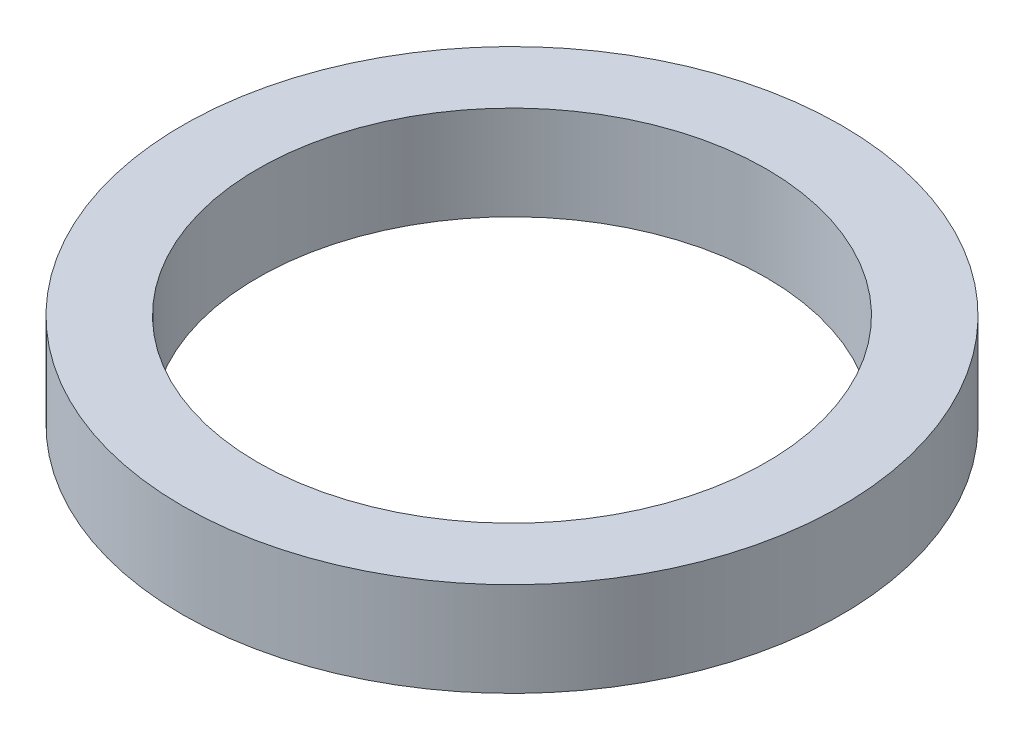
ISO-10303-21;
HEADER;
FILE_DESCRIPTION(('STEP AP214'),'2;1');
FILE_NAME('part.step','',(''),(''),'','','');
FILE_SCHEMA(('AUTOMOTIVE_DESIGN { 1 0 10303 214 1 1 1 1 }'));
ENDSEC;
DATA;
#1=APPLICATION_CONTEXT('core data for automotive mechanical design processes');
#2=APPLICATION_PROTOCOL_DEFINITION('international standard','automotive_design',2000,#1);
#3=PRODUCT_CONTEXT('',#1,'mechanical');
#4=PRODUCT('Part','Part','',(#3));
#5=PRODUCT_RELATED_PRODUCT_CATEGORY('part','',(#4));
#6=PRODUCT_DEFINITION_FORMATION('','',#4);
#7=PRODUCT_DEFINITION_CONTEXT('part definition',#1,'design');
#8=PRODUCT_DEFINITION('design','',#6,#7);
#9=PRODUCT_DEFINITION_SHAPE('','',#8);
#10=(LENGTH_UNIT() NAMED_UNIT(*) SI_UNIT(.MILLI.,.METRE.));
#11=(NAMED_UNIT(*) PLANE_ANGLE_UNIT() SI_UNIT($,.RADIAN.));
#12=(NAMED_UNIT(*) SI_UNIT($,.STERADIAN.) SOLID_ANGLE_UNIT());
#13=UNCERTAINTY_MEASURE_WITH_UNIT(LENGTH_MEASURE(1.E-05),#10,'distance_accuracy_value','');
#14=(GEOMETRIC_REPRESENTATION_CONTEXT(3) GLOBAL_UNCERTAINTY_ASSIGNED_CONTEXT((#13)) GLOBAL_UNIT_ASSIGNED_CONTEXT((#10,
#11,#12)) REPRESENTATION_CONTEXT('',''));
#15=CARTESIAN_POINT('',(0.,0.,0.));
#16=DIRECTION('',(0.,0.,1.));
#17=DIRECTION('',(1.,0.,0.));
#18=AXIS2_PLACEMENT_3D('',#15,#16,#17);
#19=CARTESIAN_POINT('',(0.,1.,0.));
#20=DIRECTION('',(0.,1.,0.));
#21=DIRECTION('',(0.,0.,1.));
#22=AXIS2_PLACEMENT_3D('',#19,#20,#21);
#23=PLANE('',#22);
#24=CARTESIAN_POINT('',(0.,1.,0.));
#25=DIRECTION('',(0.,1.,0.));
#26=DIRECTION('',(0.,0.,1.));
#27=AXIS2_PLACEMENT_3D('',#24,#25,#26);
#28=CIRCLE('',#27,3.5);
#29=CARTESIAN_POINT('',(0.,1.,3.5));
#30=VERTEX_POINT('',#29);
#31=EDGE_CURVE('E10',#30,#30,#28,.T.);
#32=ORIENTED_EDGE('',*,*,#31,.T.);
#33=EDGE_LOOP('',(#32));
#34=FACE_BOUND('',#33,.T.);
#35=CARTESIAN_POINT('',(0.,1.,0.));
#36=DIRECTION('',(0.,1.,0.));
#37=DIRECTION('',(0.,0.,1.));
#38=AXIS2_PLACEMENT_3D('',#35,#36,#37);
#39=CIRCLE('',#38,2.7);
#40=CARTESIAN_POINT('',(0.,1.,2.7));
#41=VERTEX_POINT('',#40);
#42=EDGE_CURVE('E50',#41,#41,#39,.T.);
#43=ORIENTED_EDGE('',*,*,#42,.F.);
#44=EDGE_LOOP('',(#43));
#45=FACE_BOUND('',#44,.T.);
#46=ADVANCED_FACE('F37',(#34,#45),#23,.T.);
#47=CARTESIAN_POINT('',(0.,0.,0.));
#48=DIRECTION('',(0.,1.,0.));
#49=DIRECTION('',(0.,0.,1.));
#50=AXIS2_PLACEMENT_3D('',#47,#48,#49);
#51=PLANE('',#50);
#52=CARTESIAN_POINT('',(0.,0.,0.));
#53=DIRECTION('',(0.,1.,0.));
#54=DIRECTION('',(0.,0.,1.));
#55=AXIS2_PLACEMENT_3D('',#52,#53,#54);
#56=CIRCLE('',#55,3.5);
#57=CARTESIAN_POINT('',(0.,0.,3.5));
#58=VERTEX_POINT('',#57);
#59=EDGE_CURVE('E41',#58,#58,#56,.T.);
#60=ORIENTED_EDGE('',*,*,#59,.F.);
#61=EDGE_LOOP('',(#60));
#62=FACE_BOUND('',#61,.T.);
#63=CARTESIAN_POINT('',(0.,0.,0.));
#64=DIRECTION('',(0.,1.,0.));
#65=DIRECTION('',(0.,0.,1.));
#66=AXIS2_PLACEMENT_3D('',#63,#64,#65);
#67=CIRCLE('',#66,2.7);
#68=CARTESIAN_POINT('',(0.,0.,2.7));
#69=VERTEX_POINT('',#68);
#70=EDGE_CURVE('E52',#69,#69,#67,.T.);
#71=ORIENTED_EDGE('',*,*,#70,.T.);
#72=EDGE_LOOP('',(#71));
#73=FACE_BOUND('',#72,.T.);
#74=ADVANCED_FACE('F64',(#62,#73),#51,.F.);
#75=CARTESIAN_POINT('',(0.,1.,0.));
#76=DIRECTION('',(0.,-1.,0.));
#77=DIRECTION('',(0.,0.,-1.));
#78=AXIS2_PLACEMENT_3D('',#75,#76,#77);
#79=CYLINDRICAL_SURFACE('',#78,3.5);
#80=ORIENTED_EDGE('',*,*,#31,.F.);
#81=EDGE_LOOP('',(#80));
#82=FACE_BOUND('',#81,.T.);
#83=ORIENTED_EDGE('',*,*,#59,.T.);
#84=EDGE_LOOP('',(#83));
#85=FACE_BOUND('',#84,.T.);
#86=ADVANCED_FACE('F39',(#82,#85),#79,.T.);
#87=CARTESIAN_POINT('',(0.,1.,0.));
#88=DIRECTION('',(0.,-1.,0.));
#89=DIRECTION('',(0.,0.,-1.));
#90=AXIS2_PLACEMENT_3D('',#87,#88,#89);
#91=CYLINDRICAL_SURFACE('',#90,2.7);
#92=ORIENTED_EDGE('',*,*,#42,.T.);
#93=EDGE_LOOP('',(#92));
#94=FACE_BOUND('',#93,.T.);
#95=ORIENTED_EDGE('',*,*,#70,.F.);
#96=EDGE_LOOP('',(#95));
#97=FACE_BOUND('',#96,.T.);
#98=ADVANCED_FACE('F60',(#94,#97),#91,.F.);
#99=CLOSED_SHELL('',(#46,#74,#86,#98));
#100=MANIFOLD_SOLID_BREP('B2',#99);
#101=ADVANCED_BREP_SHAPE_REPRESENTATION('',(#18,#100),#14);
#102=SHAPE_DEFINITION_REPRESENTATION(#9,#101);
ENDSEC;
END-ISO-10303-21;
